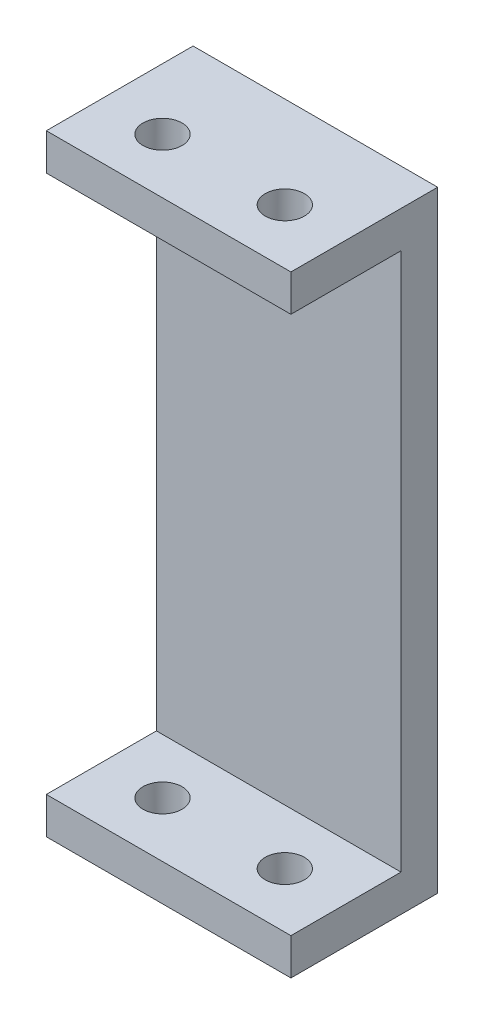
ISO-10303-21;
HEADER;
FILE_DESCRIPTION(('STEP AP214'),'2;1');
FILE_NAME('part.step','',(''),(''),'','','');
FILE_SCHEMA(('AUTOMOTIVE_DESIGN { 1 0 10303 214 1 1 1 1 }'));
ENDSEC;
DATA;
#1=APPLICATION_CONTEXT('core data for automotive mechanical design processes');
#2=APPLICATION_PROTOCOL_DEFINITION('international standard','automotive_design',2000,#1);
#3=PRODUCT_CONTEXT('',#1,'mechanical');
#4=PRODUCT('Part','Part','',(#3));
#5=PRODUCT_RELATED_PRODUCT_CATEGORY('part','',(#4));
#6=PRODUCT_DEFINITION_FORMATION('','',#4);
#7=PRODUCT_DEFINITION_CONTEXT('part definition',#1,'design');
#8=PRODUCT_DEFINITION('design','',#6,#7);
#9=PRODUCT_DEFINITION_SHAPE('','',#8);
#10=(LENGTH_UNIT() NAMED_UNIT(*) SI_UNIT(.MILLI.,.METRE.));
#11=(NAMED_UNIT(*) PLANE_ANGLE_UNIT() SI_UNIT($,.RADIAN.));
#12=(NAMED_UNIT(*) SI_UNIT($,.STERADIAN.) SOLID_ANGLE_UNIT());
#13=UNCERTAINTY_MEASURE_WITH_UNIT(LENGTH_MEASURE(1.E-05),#10,'distance_accuracy_value','');
#14=(GEOMETRIC_REPRESENTATION_CONTEXT(3) GLOBAL_UNCERTAINTY_ASSIGNED_CONTEXT((#13)) GLOBAL_UNIT_ASSIGNED_CONTEXT((#10,
#11,#12)) REPRESENTATION_CONTEXT('',''));
#15=CARTESIAN_POINT('',(0.,0.,0.));
#16=DIRECTION('',(0.,0.,1.));
#17=DIRECTION('',(1.,0.,0.));
#18=AXIS2_PLACEMENT_3D('',#15,#16,#17);
#19=CARTESIAN_POINT('',(0.,0.,12.));
#20=DIRECTION('',(0.,0.,1.));
#21=DIRECTION('',(1.,0.,0.));
#22=AXIS2_PLACEMENT_3D('',#19,#20,#21);
#23=PLANE('',#22);
#24=DIRECTION('',(0.,-1.,0.));
#25=VECTOR('',#24,1.);
#26=CARTESIAN_POINT('',(-15.8038585209003,24.0916398713826,12.));
#27=LINE('',#26,#25);
#28=CARTESIAN_POINT('',(-15.8038585209003,24.0916398713826,12.));
#29=VERTEX_POINT('',#28);
#30=CARTESIAN_POINT('',(-15.8038585209003,21.0916398713826,12.));
#31=VERTEX_POINT('',#30);
#32=EDGE_CURVE('E170',#29,#31,#27,.T.);
#33=ORIENTED_EDGE('',*,*,#32,.T.);
#34=DIRECTION('',(1.,0.,0.));
#35=VECTOR('',#34,1.);
#36=CARTESIAN_POINT('',(-15.8038585209003,21.0916398713826,12.));
#37=LINE('',#36,#35);
#38=CARTESIAN_POINT('',(4.19614147909971,21.0916398713826,12.));
#39=VERTEX_POINT('',#38);
#40=EDGE_CURVE('E142',#31,#39,#37,.T.);
#41=ORIENTED_EDGE('',*,*,#40,.T.);
#42=DIRECTION('',(0.,1.,0.));
#43=VECTOR('',#42,1.);
#44=CARTESIAN_POINT('',(4.19614147909971,24.0916398713826,12.));
#45=LINE('',#44,#43);
#46=CARTESIAN_POINT('',(4.19614147909971,24.0916398713826,12.));
#47=VERTEX_POINT('',#46);
#48=EDGE_CURVE('E176',#39,#47,#45,.T.);
#49=ORIENTED_EDGE('',*,*,#48,.T.);
#50=DIRECTION('',(-1.,0.,0.));
#51=VECTOR('',#50,1.);
#52=CARTESIAN_POINT('',(-15.8038585209003,24.0916398713826,12.));
#53=LINE('',#52,#51);
#54=EDGE_CURVE('E70',#47,#29,#53,.T.);
#55=ORIENTED_EDGE('',*,*,#54,.T.);
#56=EDGE_LOOP('',(#33,#41,#49,#55));
#57=FACE_BOUND('',#56,.T.);
#58=ADVANCED_FACE('F43',(#57),#23,.T.);
#59=CARTESIAN_POINT('',(-15.8038585209003,24.0916398713826,12.));
#60=DIRECTION('',(1.,0.,0.));
#61=DIRECTION('',(0.,1.,0.));
#62=AXIS2_PLACEMENT_3D('',#59,#60,#61);
#63=PLANE('',#62);
#64=CARTESIAN_POINT('',(-15.8038585209003,-22.9083601286174,12.));
#65=VERTEX_POINT('',#64);
#66=CARTESIAN_POINT('',(-15.8038585209003,-25.9083601286174,12.));
#67=VERTEX_POINT('',#66);
#68=EDGE_CURVE('E99',#65,#67,#27,.T.);
#69=ORIENTED_EDGE('',*,*,#68,.F.);
#70=DIRECTION('',(0.,0.,1.));
#71=VECTOR('',#70,1.);
#72=CARTESIAN_POINT('',(-15.8038585209003,-22.9083601286174,3.));
#73=LINE('',#72,#71);
#74=CARTESIAN_POINT('',(-15.8038585209003,-22.9083601286174,3.));
#75=VERTEX_POINT('',#74);
#76=EDGE_CURVE('E160',#75,#65,#73,.T.);
#77=ORIENTED_EDGE('',*,*,#76,.F.);
#78=DIRECTION('',(0.,-1.,0.));
#79=VECTOR('',#78,1.);
#80=CARTESIAN_POINT('',(-15.8038585209003,21.0916398713826,3.));
#81=LINE('',#80,#79);
#82=CARTESIAN_POINT('',(-15.8038585209003,21.0916398713826,3.));
#83=VERTEX_POINT('',#82);
#84=EDGE_CURVE('E132',#83,#75,#81,.T.);
#85=ORIENTED_EDGE('',*,*,#84,.F.);
#86=DIRECTION('',(0.,0.,1.));
#87=VECTOR('',#86,1.);
#88=CARTESIAN_POINT('',(-15.8038585209003,21.0916398713826,3.));
#89=LINE('',#88,#87);
#90=EDGE_CURVE('E164',#83,#31,#89,.T.);
#91=ORIENTED_EDGE('',*,*,#90,.T.);
#92=ORIENTED_EDGE('',*,*,#32,.F.);
#93=DIRECTION('',(0.,0.,-1.));
#94=VECTOR('',#93,1.);
#95=CARTESIAN_POINT('',(-15.8038585209003,24.0916398713826,12.));
#96=LINE('',#95,#94);
#97=CARTESIAN_POINT('',(-15.8038585209003,24.0916398713826,0.));
#98=VERTEX_POINT('',#97);
#99=EDGE_CURVE('E182',#29,#98,#96,.T.);
#100=ORIENTED_EDGE('',*,*,#99,.T.);
#101=DIRECTION('',(0.,-1.,0.));
#102=VECTOR('',#101,1.);
#103=CARTESIAN_POINT('',(-15.8038585209003,24.0916398713826,0.));
#104=LINE('',#103,#102);
#105=CARTESIAN_POINT('',(-15.8038585209003,-25.9083601286174,0.));
#106=VERTEX_POINT('',#105);
#107=EDGE_CURVE('E163',#98,#106,#104,.T.);
#108=ORIENTED_EDGE('',*,*,#107,.T.);
#109=DIRECTION('',(0.,0.,-1.));
#110=VECTOR('',#109,1.);
#111=CARTESIAN_POINT('',(-15.8038585209003,-25.9083601286174,12.));
#112=LINE('',#111,#110);
#113=EDGE_CURVE('E11',#67,#106,#112,.T.);
#114=ORIENTED_EDGE('',*,*,#113,.F.);
#115=EDGE_LOOP('',(#69,#77,#85,#91,#92,#100,#108,#114));
#116=FACE_BOUND('',#115,.T.);
#117=ADVANCED_FACE('F45',(#116),#63,.F.);
#118=CARTESIAN_POINT('',(-15.8038585209003,-25.9083601286174,12.));
#119=DIRECTION('',(0.,1.,0.));
#120=DIRECTION('',(0.,0.,1.));
#121=AXIS2_PLACEMENT_3D('',#118,#119,#120);
#122=PLANE('',#121);
#123=CARTESIAN_POINT('',(-0.80385852090029,-25.9083601286174,7.5));
#124=DIRECTION('',(0.,1.,0.));
#125=DIRECTION('',(0.,0.,1.));
#126=AXIS2_PLACEMENT_3D('',#123,#124,#125);
#127=CIRCLE('',#126,1.6);
#128=CARTESIAN_POINT('',(-0.80385852090029,-25.9083601286174,9.1));
#129=VERTEX_POINT('',#128);
#130=EDGE_CURVE('E205',#129,#129,#127,.T.);
#131=ORIENTED_EDGE('',*,*,#130,.T.);
#132=EDGE_LOOP('',(#131));
#133=FACE_BOUND('',#132,.T.);
#134=CARTESIAN_POINT('',(-10.8038585209003,-25.9083601286174,7.5));
#135=DIRECTION('',(0.,1.,0.));
#136=DIRECTION('',(0.,0.,1.));
#137=AXIS2_PLACEMENT_3D('',#134,#135,#136);
#138=CIRCLE('',#137,1.6);
#139=CARTESIAN_POINT('',(-10.8038585209003,-25.9083601286174,9.1));
#140=VERTEX_POINT('',#139);
#141=EDGE_CURVE('E225',#140,#140,#138,.T.);
#142=ORIENTED_EDGE('',*,*,#141,.T.);
#143=EDGE_LOOP('',(#142));
#144=FACE_BOUND('',#143,.T.);
#145=DIRECTION('',(1.,0.,0.));
#146=VECTOR('',#145,1.);
#147=CARTESIAN_POINT('',(-15.8038585209003,-25.9083601286174,0.));
#148=LINE('',#147,#146);
#149=CARTESIAN_POINT('',(4.19614147909972,-25.9083601286174,0.));
#150=VERTEX_POINT('',#149);
#151=EDGE_CURVE('E186',#106,#150,#148,.T.);
#152=ORIENTED_EDGE('',*,*,#151,.T.);
#153=DIRECTION('',(0.,0.,-1.));
#154=VECTOR('',#153,1.);
#155=CARTESIAN_POINT('',(4.19614147909972,-25.9083601286174,12.));
#156=LINE('',#155,#154);
#157=CARTESIAN_POINT('',(4.19614147909972,-25.9083601286174,12.));
#158=VERTEX_POINT('',#157);
#159=EDGE_CURVE('E53',#158,#150,#156,.T.);
#160=ORIENTED_EDGE('',*,*,#159,.F.);
#161=DIRECTION('',(1.,0.,0.));
#162=VECTOR('',#161,1.);
#163=CARTESIAN_POINT('',(-15.8038585209003,-25.9083601286174,12.));
#164=LINE('',#163,#162);
#165=EDGE_CURVE('E173',#67,#158,#164,.T.);
#166=ORIENTED_EDGE('',*,*,#165,.F.);
#167=ORIENTED_EDGE('',*,*,#113,.T.);
#168=EDGE_LOOP('',(#152,#160,#166,#167));
#169=FACE_BOUND('',#168,.T.);
#170=ADVANCED_FACE('F251',(#133,#144,#169),#122,.F.);
#171=CARTESIAN_POINT('',(4.19614147909971,24.0916398713826,12.));
#172=DIRECTION('',(-1.,0.,0.));
#173=DIRECTION('',(0.,-1.,0.));
#174=AXIS2_PLACEMENT_3D('',#171,#172,#173);
#175=PLANE('',#174);
#176=DIRECTION('',(0.,-1.,0.));
#177=VECTOR('',#176,1.);
#178=CARTESIAN_POINT('',(4.19614147909971,21.0916398713826,3.));
#179=LINE('',#178,#177);
#180=CARTESIAN_POINT('',(4.19614147909971,21.0916398713826,3.));
#181=VERTEX_POINT('',#180);
#182=CARTESIAN_POINT('',(4.19614147909972,-22.9083601286174,3.));
#183=VERTEX_POINT('',#182);
#184=EDGE_CURVE('E138',#181,#183,#179,.T.);
#185=ORIENTED_EDGE('',*,*,#184,.T.);
#186=DIRECTION('',(0.,0.,1.));
#187=VECTOR('',#186,1.);
#188=CARTESIAN_POINT('',(4.19614147909972,-22.9083601286174,3.));
#189=LINE('',#188,#187);
#190=CARTESIAN_POINT('',(4.19614147909972,-22.9083601286174,12.));
#191=VERTEX_POINT('',#190);
#192=EDGE_CURVE('E121',#183,#191,#189,.T.);
#193=ORIENTED_EDGE('',*,*,#192,.T.);
#194=EDGE_CURVE('E177',#158,#191,#45,.T.);
#195=ORIENTED_EDGE('',*,*,#194,.F.);
#196=ORIENTED_EDGE('',*,*,#159,.T.);
#197=DIRECTION('',(0.,1.,0.));
#198=VECTOR('',#197,1.);
#199=CARTESIAN_POINT('',(4.19614147909971,24.0916398713826,0.));
#200=LINE('',#199,#198);
#201=CARTESIAN_POINT('',(4.19614147909971,24.0916398713826,0.));
#202=VERTEX_POINT('',#201);
#203=EDGE_CURVE('E189',#150,#202,#200,.T.);
#204=ORIENTED_EDGE('',*,*,#203,.T.);
#205=DIRECTION('',(0.,0.,-1.));
#206=VECTOR('',#205,1.);
#207=CARTESIAN_POINT('',(4.19614147909971,24.0916398713826,12.));
#208=LINE('',#207,#206);
#209=EDGE_CURVE('E196',#47,#202,#208,.T.);
#210=ORIENTED_EDGE('',*,*,#209,.F.);
#211=ORIENTED_EDGE('',*,*,#48,.F.);
#212=DIRECTION('',(0.,0.,1.));
#213=VECTOR('',#212,1.);
#214=CARTESIAN_POINT('',(4.19614147909971,21.0916398713826,3.));
#215=LINE('',#214,#213);
#216=EDGE_CURVE('E61',#181,#39,#215,.T.);
#217=ORIENTED_EDGE('',*,*,#216,.F.);
#218=EDGE_LOOP('',(#185,#193,#195,#196,#204,#210,#211,#217));
#219=FACE_BOUND('',#218,.T.);
#220=ADVANCED_FACE('F144',(#219),#175,.F.);
#221=CARTESIAN_POINT('',(-15.8038585209003,24.0916398713826,12.));
#222=DIRECTION('',(0.,-1.,0.));
#223=DIRECTION('',(0.,0.,-1.));
#224=AXIS2_PLACEMENT_3D('',#221,#222,#223);
#225=PLANE('',#224);
#226=CARTESIAN_POINT('',(-0.80385852090029,24.0916398713826,7.5));
#227=DIRECTION('',(0.,1.,0.));
#228=DIRECTION('',(0.,0.,1.));
#229=AXIS2_PLACEMENT_3D('',#226,#227,#228);
#230=CIRCLE('',#229,1.6);
#231=CARTESIAN_POINT('',(-0.80385852090029,24.0916398713826,9.1));
#232=VERTEX_POINT('',#231);
#233=EDGE_CURVE('E213',#232,#232,#230,.T.);
#234=ORIENTED_EDGE('',*,*,#233,.F.);
#235=EDGE_LOOP('',(#234));
#236=FACE_BOUND('',#235,.T.);
#237=CARTESIAN_POINT('',(-10.8038585209003,24.0916398713826,7.5));
#238=DIRECTION('',(0.,1.,0.));
#239=DIRECTION('',(0.,0.,1.));
#240=AXIS2_PLACEMENT_3D('',#237,#238,#239);
#241=CIRCLE('',#240,1.6);
#242=CARTESIAN_POINT('',(-10.8038585209003,24.0916398713826,9.1));
#243=VERTEX_POINT('',#242);
#244=EDGE_CURVE('E219',#243,#243,#241,.T.);
#245=ORIENTED_EDGE('',*,*,#244,.F.);
#246=EDGE_LOOP('',(#245));
#247=FACE_BOUND('',#246,.T.);
#248=DIRECTION('',(-1.,0.,0.));
#249=VECTOR('',#248,1.);
#250=CARTESIAN_POINT('',(-15.8038585209003,24.0916398713826,0.));
#251=LINE('',#250,#249);
#252=EDGE_CURVE('E91',#202,#98,#251,.T.);
#253=ORIENTED_EDGE('',*,*,#252,.T.);
#254=ORIENTED_EDGE('',*,*,#99,.F.);
#255=ORIENTED_EDGE('',*,*,#54,.F.);
#256=ORIENTED_EDGE('',*,*,#209,.T.);
#257=EDGE_LOOP('',(#253,#254,#255,#256));
#258=FACE_BOUND('',#257,.T.);
#259=ADVANCED_FACE('F256',(#236,#247,#258),#225,.F.);
#260=DIRECTION('',(1.,0.,0.));
#261=VECTOR('',#260,1.);
#262=CARTESIAN_POINT('',(-15.8038585209003,-22.9083601286174,12.));
#263=LINE('',#262,#261);
#264=EDGE_CURVE('E126',#65,#191,#263,.T.);
#265=ORIENTED_EDGE('',*,*,#264,.F.);
#266=ORIENTED_EDGE('',*,*,#68,.T.);
#267=ORIENTED_EDGE('',*,*,#165,.T.);
#268=ORIENTED_EDGE('',*,*,#194,.T.);
#269=EDGE_LOOP('',(#265,#266,#267,#268));
#270=FACE_BOUND('',#269,.T.);
#271=ADVANCED_FACE('F247',(#270),#23,.T.);
#272=CARTESIAN_POINT('',(0.,0.,0.));
#273=DIRECTION('',(0.,0.,1.));
#274=DIRECTION('',(1.,0.,0.));
#275=AXIS2_PLACEMENT_3D('',#272,#273,#274);
#276=PLANE('',#275);
#277=ORIENTED_EDGE('',*,*,#107,.F.);
#278=ORIENTED_EDGE('',*,*,#252,.F.);
#279=ORIENTED_EDGE('',*,*,#203,.F.);
#280=ORIENTED_EDGE('',*,*,#151,.F.);
#281=EDGE_LOOP('',(#277,#278,#279,#280));
#282=FACE_BOUND('',#281,.T.);
#283=ADVANCED_FACE('F255',(#282),#276,.F.);
#284=CARTESIAN_POINT('',(-15.8038585209003,-22.9083601286174,3.));
#285=DIRECTION('',(0.,-1.,0.));
#286=DIRECTION('',(0.,0.,-1.));
#287=AXIS2_PLACEMENT_3D('',#284,#285,#286);
#288=PLANE('',#287);
#289=CARTESIAN_POINT('',(-0.80385852090029,-22.9083601286174,7.5));
#290=DIRECTION('',(0.,-1.,0.));
#291=DIRECTION('',(0.,0.,-1.));
#292=AXIS2_PLACEMENT_3D('',#289,#290,#291);
#293=CIRCLE('',#292,1.6);
#294=CARTESIAN_POINT('',(-0.80385852090029,-22.9083601286174,5.9));
#295=VERTEX_POINT('',#294);
#296=EDGE_CURVE('E157',#295,#295,#293,.T.);
#297=ORIENTED_EDGE('',*,*,#296,.T.);
#298=EDGE_LOOP('',(#297));
#299=FACE_BOUND('',#298,.T.);
#300=CARTESIAN_POINT('',(-10.8038585209003,-22.9083601286174,7.5));
#301=DIRECTION('',(0.,-1.,0.));
#302=DIRECTION('',(0.,0.,-1.));
#303=AXIS2_PLACEMENT_3D('',#300,#301,#302);
#304=CIRCLE('',#303,1.6);
#305=CARTESIAN_POINT('',(-10.8038585209003,-22.9083601286174,5.9));
#306=VERTEX_POINT('',#305);
#307=EDGE_CURVE('E204',#306,#306,#304,.T.);
#308=ORIENTED_EDGE('',*,*,#307,.T.);
#309=EDGE_LOOP('',(#308));
#310=FACE_BOUND('',#309,.T.);
#311=ORIENTED_EDGE('',*,*,#264,.T.);
#312=ORIENTED_EDGE('',*,*,#192,.F.);
#313=DIRECTION('',(1.,0.,0.));
#314=VECTOR('',#313,1.);
#315=CARTESIAN_POINT('',(-15.8038585209003,-22.9083601286174,3.));
#316=LINE('',#315,#314);
#317=EDGE_CURVE('E124',#75,#183,#316,.T.);
#318=ORIENTED_EDGE('',*,*,#317,.F.);
#319=ORIENTED_EDGE('',*,*,#76,.T.);
#320=EDGE_LOOP('',(#311,#312,#318,#319));
#321=FACE_BOUND('',#320,.T.);
#322=ADVANCED_FACE('F123',(#299,#310,#321),#288,.F.);
#323=CARTESIAN_POINT('',(-15.8038585209003,21.0916398713826,3.));
#324=DIRECTION('',(0.,-1.,0.));
#325=DIRECTION('',(0.,0.,-1.));
#326=AXIS2_PLACEMENT_3D('',#323,#324,#325);
#327=PLANE('',#326);
#328=CARTESIAN_POINT('',(-0.80385852090029,21.0916398713826,7.5));
#329=DIRECTION('',(0.,-1.,0.));
#330=DIRECTION('',(0.,0.,-1.));
#331=AXIS2_PLACEMENT_3D('',#328,#329,#330);
#332=CIRCLE('',#331,1.6);
#333=CARTESIAN_POINT('',(-0.80385852090029,21.0916398713826,5.9));
#334=VERTEX_POINT('',#333);
#335=EDGE_CURVE('E47',#334,#334,#332,.T.);
#336=ORIENTED_EDGE('',*,*,#335,.F.);
#337=EDGE_LOOP('',(#336));
#338=FACE_BOUND('',#337,.T.);
#339=CARTESIAN_POINT('',(-10.8038585209003,21.0916398713826,7.5));
#340=DIRECTION('',(0.,-1.,0.));
#341=DIRECTION('',(0.,0.,-1.));
#342=AXIS2_PLACEMENT_3D('',#339,#340,#341);
#343=CIRCLE('',#342,1.6);
#344=CARTESIAN_POINT('',(-10.8038585209003,21.0916398713826,5.9));
#345=VERTEX_POINT('',#344);
#346=EDGE_CURVE('E201',#345,#345,#343,.T.);
#347=ORIENTED_EDGE('',*,*,#346,.F.);
#348=EDGE_LOOP('',(#347));
#349=FACE_BOUND('',#348,.T.);
#350=ORIENTED_EDGE('',*,*,#40,.F.);
#351=ORIENTED_EDGE('',*,*,#90,.F.);
#352=DIRECTION('',(1.,0.,0.));
#353=VECTOR('',#352,1.);
#354=CARTESIAN_POINT('',(-15.8038585209003,21.0916398713826,3.));
#355=LINE('',#354,#353);
#356=EDGE_CURVE('E147',#83,#181,#355,.T.);
#357=ORIENTED_EDGE('',*,*,#356,.T.);
#358=ORIENTED_EDGE('',*,*,#216,.T.);
#359=EDGE_LOOP('',(#350,#351,#357,#358));
#360=FACE_BOUND('',#359,.T.);
#361=ADVANCED_FACE('F239',(#338,#349,#360),#327,.T.);
#362=CARTESIAN_POINT('',(0.,0.,3.));
#363=DIRECTION('',(0.,0.,-1.));
#364=DIRECTION('',(-1.,0.,0.));
#365=AXIS2_PLACEMENT_3D('',#362,#363,#364);
#366=PLANE('',#365);
#367=ORIENTED_EDGE('',*,*,#317,.T.);
#368=ORIENTED_EDGE('',*,*,#184,.F.);
#369=ORIENTED_EDGE('',*,*,#356,.F.);
#370=ORIENTED_EDGE('',*,*,#84,.T.);
#371=EDGE_LOOP('',(#367,#368,#369,#370));
#372=FACE_BOUND('',#371,.T.);
#373=ADVANCED_FACE('F136',(#372),#366,.F.);
#374=CARTESIAN_POINT('',(-10.8038585209003,-25.9083601286174,7.5));
#375=DIRECTION('',(0.,1.,0.));
#376=DIRECTION('',(0.,0.,1.));
#377=AXIS2_PLACEMENT_3D('',#374,#375,#376);
#378=CYLINDRICAL_SURFACE('',#377,1.6);
#379=ORIENTED_EDGE('',*,*,#346,.T.);
#380=EDGE_LOOP('',(#379));
#381=FACE_BOUND('',#380,.T.);
#382=ORIENTED_EDGE('',*,*,#244,.T.);
#383=EDGE_LOOP('',(#382));
#384=FACE_BOUND('',#383,.T.);
#385=ADVANCED_FACE('F285',(#381,#384),#378,.F.);
#386=CARTESIAN_POINT('',(-0.80385852090029,-25.9083601286174,7.5));
#387=DIRECTION('',(0.,1.,0.));
#388=DIRECTION('',(0.,0.,1.));
#389=AXIS2_PLACEMENT_3D('',#386,#387,#388);
#390=CYLINDRICAL_SURFACE('',#389,1.6);
#391=ORIENTED_EDGE('',*,*,#335,.T.);
#392=EDGE_LOOP('',(#391));
#393=FACE_BOUND('',#392,.T.);
#394=ORIENTED_EDGE('',*,*,#233,.T.);
#395=EDGE_LOOP('',(#394));
#396=FACE_BOUND('',#395,.T.);
#397=ADVANCED_FACE('F236',(#393,#396),#390,.F.);
#398=ORIENTED_EDGE('',*,*,#141,.F.);
#399=EDGE_LOOP('',(#398));
#400=FACE_BOUND('',#399,.T.);
#401=ORIENTED_EDGE('',*,*,#307,.F.);
#402=EDGE_LOOP('',(#401));
#403=FACE_BOUND('',#402,.T.);
#404=ADVANCED_FACE('F280',(#400,#403),#378,.F.);
#405=ORIENTED_EDGE('',*,*,#130,.F.);
#406=EDGE_LOOP('',(#405));
#407=FACE_BOUND('',#406,.T.);
#408=ORIENTED_EDGE('',*,*,#296,.F.);
#409=EDGE_LOOP('',(#408));
#410=FACE_BOUND('',#409,.T.);
#411=ADVANCED_FACE('F283',(#407,#410),#390,.F.);
#412=CLOSED_SHELL('',(#58,#117,#170,#220,#259,#271,#283,#322,#361,#373,#385,#397,#404,#411));
#413=MANIFOLD_SOLID_BREP('B2',#412);
#414=ADVANCED_BREP_SHAPE_REPRESENTATION('',(#18,#413),#14);
#415=SHAPE_DEFINITION_REPRESENTATION(#9,#414);
ENDSEC;
END-ISO-10303-21;
